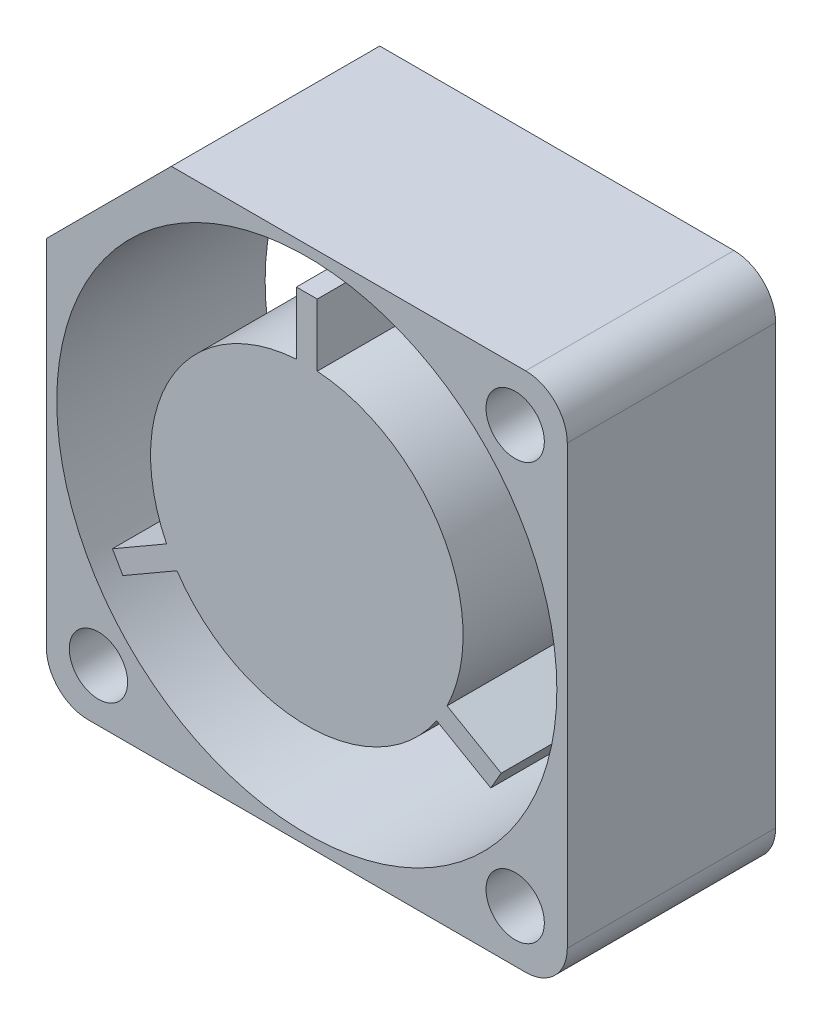
ISO-10303-21;
HEADER;
FILE_DESCRIPTION(('STEP AP214'),'2;1');
FILE_NAME('part.step','',(''),(''),'','','');
FILE_SCHEMA(('AUTOMOTIVE_DESIGN { 1 0 10303 214 1 1 1 1 }'));
ENDSEC;
DATA;
#1=APPLICATION_CONTEXT('core data for automotive mechanical design processes');
#2=APPLICATION_PROTOCOL_DEFINITION('international standard','automotive_design',2000,#1);
#3=PRODUCT_CONTEXT('',#1,'mechanical');
#4=PRODUCT('Part','Part','',(#3));
#5=PRODUCT_RELATED_PRODUCT_CATEGORY('part','',(#4));
#6=PRODUCT_DEFINITION_FORMATION('','',#4);
#7=PRODUCT_DEFINITION_CONTEXT('part definition',#1,'design');
#8=PRODUCT_DEFINITION('design','',#6,#7);
#9=PRODUCT_DEFINITION_SHAPE('','',#8);
#10=(LENGTH_UNIT() NAMED_UNIT(*) SI_UNIT(.MILLI.,.METRE.));
#11=(NAMED_UNIT(*) PLANE_ANGLE_UNIT() SI_UNIT($,.RADIAN.));
#12=(NAMED_UNIT(*) SI_UNIT($,.STERADIAN.) SOLID_ANGLE_UNIT());
#13=UNCERTAINTY_MEASURE_WITH_UNIT(LENGTH_MEASURE(1.E-05),#10,'distance_accuracy_value','');
#14=(GEOMETRIC_REPRESENTATION_CONTEXT(3) GLOBAL_UNCERTAINTY_ASSIGNED_CONTEXT((#13)) GLOBAL_UNIT_ASSIGNED_CONTEXT((#10,
#11,#12)) REPRESENTATION_CONTEXT('',''));
#15=CARTESIAN_POINT('',(0.,0.,0.));
#16=DIRECTION('',(0.,0.,1.));
#17=DIRECTION('',(1.,0.,0.));
#18=AXIS2_PLACEMENT_3D('',#15,#16,#17);
#19=CARTESIAN_POINT('',(-0.5,10.4833147735479,-30.9134503682525));
#20=DIRECTION('',(-1.,0.,0.));
#21=DIRECTION('',(0.,-1.,0.));
#22=AXIS2_PLACEMENT_3D('',#19,#20,#21);
#23=PLANE('',#22);
#24=DIRECTION('',(0.,1.,0.));
#25=VECTOR('',#24,1.);
#26=CARTESIAN_POINT('',(-0.5,10.4833147735479,-5.));
#27=LINE('',#26,#25);
#28=CARTESIAN_POINT('',(-0.500000000000001,7.48331477354788,-5.));
#29=VERTEX_POINT('',#28);
#30=CARTESIAN_POINT('',(-0.5,10.4833147735479,-5.));
#31=VERTEX_POINT('',#30);
#32=EDGE_CURVE('E49',#29,#31,#27,.T.);
#33=ORIENTED_EDGE('',*,*,#32,.F.);
#34=DIRECTION('',(0.,0.,1.));
#35=VECTOR('',#34,1.);
#36=CARTESIAN_POINT('',(-0.500000000000001,7.48331477354788,-30.9134503682525));
#37=LINE('',#36,#35);
#38=CARTESIAN_POINT('',(-0.500000000000001,7.48331477354788,5.));
#39=VERTEX_POINT('',#38);
#40=EDGE_CURVE('E123',#29,#39,#37,.T.);
#41=ORIENTED_EDGE('',*,*,#40,.T.);
#42=DIRECTION('',(0.,-1.,0.));
#43=VECTOR('',#42,1.);
#44=CARTESIAN_POINT('',(-0.5,10.4833147735479,5.));
#45=LINE('',#44,#43);
#46=CARTESIAN_POINT('',(-0.5,10.4833147735479,5.));
#47=VERTEX_POINT('',#46);
#48=EDGE_CURVE('E227',#47,#39,#45,.T.);
#49=ORIENTED_EDGE('',*,*,#48,.F.);
#50=DIRECTION('',(0.,0.,1.));
#51=VECTOR('',#50,1.);
#52=CARTESIAN_POINT('',(-0.5,10.4833147735479,-30.9134503682525));
#53=LINE('',#52,#51);
#54=EDGE_CURVE('E143',#31,#47,#53,.T.);
#55=ORIENTED_EDGE('',*,*,#54,.F.);
#56=EDGE_LOOP('',(#33,#41,#49,#55));
#57=FACE_BOUND('',#56,.T.);
#58=ADVANCED_FACE('F41',(#57),#23,.T.);
#59=CARTESIAN_POINT('',(-0.5,10.4833147735479,-30.9134503682525));
#60=DIRECTION('',(0.,1.,0.));
#61=DIRECTION('',(0.,0.,1.));
#62=AXIS2_PLACEMENT_3D('',#59,#60,#61);
#63=PLANE('',#62);
#64=DIRECTION('',(1.,0.,0.));
#65=VECTOR('',#64,1.);
#66=CARTESIAN_POINT('',(-0.5,10.4833147735479,-5.));
#67=LINE('',#66,#65);
#68=CARTESIAN_POINT('',(0.5,10.4833147735479,-5.));
#69=VERTEX_POINT('',#68);
#70=EDGE_CURVE('E238',#31,#69,#67,.T.);
#71=ORIENTED_EDGE('',*,*,#70,.F.);
#72=ORIENTED_EDGE('',*,*,#54,.T.);
#73=DIRECTION('',(-1.,0.,0.));
#74=VECTOR('',#73,1.);
#75=CARTESIAN_POINT('',(-0.5,10.4833147735479,5.));
#76=LINE('',#75,#74);
#77=CARTESIAN_POINT('',(0.5,10.4833147735479,5.));
#78=VERTEX_POINT('',#77);
#79=EDGE_CURVE('E125',#78,#47,#76,.T.);
#80=ORIENTED_EDGE('',*,*,#79,.F.);
#81=DIRECTION('',(0.,0.,1.));
#82=VECTOR('',#81,1.);
#83=CARTESIAN_POINT('',(0.5,10.4833147735479,-30.9134503682525));
#84=LINE('',#83,#82);
#85=EDGE_CURVE('E146',#69,#78,#84,.T.);
#86=ORIENTED_EDGE('',*,*,#85,.F.);
#87=EDGE_LOOP('',(#71,#72,#80,#86));
#88=FACE_BOUND('',#87,.T.);
#89=ADVANCED_FACE('F265',(#88),#63,.T.);
#90=CARTESIAN_POINT('',(0.5,10.4833147735479,-30.9134503682525));
#91=DIRECTION('',(1.,0.,0.));
#92=DIRECTION('',(0.,1.,0.));
#93=AXIS2_PLACEMENT_3D('',#90,#91,#92);
#94=PLANE('',#93);
#95=DIRECTION('',(0.,-1.,0.));
#96=VECTOR('',#95,1.);
#97=CARTESIAN_POINT('',(0.5,10.4833147735479,-5.));
#98=LINE('',#97,#96);
#99=CARTESIAN_POINT('',(0.500000000000001,7.48331477354788,-5.));
#100=VERTEX_POINT('',#99);
#101=EDGE_CURVE('E240',#69,#100,#98,.T.);
#102=ORIENTED_EDGE('',*,*,#101,.F.);
#103=ORIENTED_EDGE('',*,*,#85,.T.);
#104=DIRECTION('',(0.,1.,0.));
#105=VECTOR('',#104,1.);
#106=CARTESIAN_POINT('',(0.5,10.4833147735479,5.));
#107=LINE('',#106,#105);
#108=CARTESIAN_POINT('',(0.500000000000001,7.48331477354788,5.));
#109=VERTEX_POINT('',#108);
#110=EDGE_CURVE('E132',#109,#78,#107,.T.);
#111=ORIENTED_EDGE('',*,*,#110,.F.);
#112=DIRECTION('',(0.,0.,1.));
#113=VECTOR('',#112,1.);
#114=CARTESIAN_POINT('',(0.500000000000001,7.48331477354788,-30.9134503682525));
#115=LINE('',#114,#113);
#116=EDGE_CURVE('E149',#100,#109,#115,.T.);
#117=ORIENTED_EDGE('',*,*,#116,.F.);
#118=EDGE_LOOP('',(#102,#103,#111,#117));
#119=FACE_BOUND('',#118,.T.);
#120=ADVANCED_FACE('F262',(#119),#94,.T.);
#121=CARTESIAN_POINT('',(0.,0.,-30.9134503682525));
#122=DIRECTION('',(0.,0.,1.));
#123=DIRECTION('',(1.,0.,0.));
#124=AXIS2_PLACEMENT_3D('',#121,#122,#123);
#125=CYLINDRICAL_SURFACE('',#124,7.5);
#126=CARTESIAN_POINT('',(0.,0.,-5.));
#127=DIRECTION('',(0.,0.,1.));
#128=DIRECTION('',(1.,0.,0.));
#129=AXIS2_PLACEMENT_3D('',#126,#127,#128);
#130=CIRCLE('',#129,7.5);
#131=CARTESIAN_POINT('',(6.73074069840784,-3.30864468488175,-5.));
#132=VERTEX_POINT('',#131);
#133=EDGE_CURVE('E242',#100,#132,#130,.F.);
#134=ORIENTED_EDGE('',*,*,#133,.F.);
#135=ORIENTED_EDGE('',*,*,#116,.T.);
#136=CARTESIAN_POINT('',(0.,0.,5.));
#137=DIRECTION('',(0.,0.,1.));
#138=DIRECTION('',(1.,0.,0.));
#139=AXIS2_PLACEMENT_3D('',#136,#137,#138);
#140=CIRCLE('',#139,7.5);
#141=CARTESIAN_POINT('',(6.73074069840784,-3.30864468488175,5.));
#142=VERTEX_POINT('',#141);
#143=EDGE_CURVE('E139',#142,#109,#140,.T.);
#144=ORIENTED_EDGE('',*,*,#143,.F.);
#145=DIRECTION('',(0.,0.,1.));
#146=VECTOR('',#145,1.);
#147=CARTESIAN_POINT('',(6.73074069840784,-3.30864468488175,-30.9134503682525));
#148=LINE('',#147,#146);
#149=EDGE_CURVE('E152',#132,#142,#148,.T.);
#150=ORIENTED_EDGE('',*,*,#149,.F.);
#151=EDGE_LOOP('',(#134,#135,#144,#150));
#152=FACE_BOUND('',#151,.T.);
#153=ADVANCED_FACE('F202',(#152),#125,.T.);
#154=CARTESIAN_POINT('',(9.32881690976115,-4.80864468488176,-30.9134503682525));
#155=DIRECTION('',(0.500000000000005,0.866025403784436,0.));
#156=DIRECTION('',(-0.866025403784436,0.500000000000005,0.));
#157=AXIS2_PLACEMENT_3D('',#154,#155,#156);
#158=PLANE('',#157);
#159=DIRECTION('',(0.866025403784436,-0.500000000000005,0.));
#160=VECTOR('',#159,1.);
#161=CARTESIAN_POINT('',(9.32881690976115,-4.80864468488176,-5.));
#162=LINE('',#161,#160);
#163=CARTESIAN_POINT('',(9.32881690976115,-4.80864468488176,-5.));
#164=VERTEX_POINT('',#163);
#165=EDGE_CURVE('E244',#132,#164,#162,.T.);
#166=ORIENTED_EDGE('',*,*,#165,.F.);
#167=ORIENTED_EDGE('',*,*,#149,.T.);
#168=DIRECTION('',(-0.866025403784436,0.500000000000005,0.));
#169=VECTOR('',#168,1.);
#170=CARTESIAN_POINT('',(9.32881690976115,-4.80864468488176,5.));
#171=LINE('',#170,#169);
#172=CARTESIAN_POINT('',(9.32881690976115,-4.80864468488176,5.));
#173=VERTEX_POINT('',#172);
#174=EDGE_CURVE('E189',#173,#142,#171,.T.);
#175=ORIENTED_EDGE('',*,*,#174,.F.);
#176=DIRECTION('',(0.,0.,1.));
#177=VECTOR('',#176,1.);
#178=CARTESIAN_POINT('',(9.32881690976115,-4.80864468488176,-30.9134503682525));
#179=LINE('',#178,#177);
#180=EDGE_CURVE('E155',#164,#173,#179,.T.);
#181=ORIENTED_EDGE('',*,*,#180,.F.);
#182=EDGE_LOOP('',(#166,#167,#175,#181));
#183=FACE_BOUND('',#182,.T.);
#184=ADVANCED_FACE('F254',(#183),#158,.T.);
#185=CARTESIAN_POINT('',(8.82881690976115,-5.6746700886662,-30.9134503682525));
#186=DIRECTION('',(0.866025403784437,-0.500000000000003,0.));
#187=DIRECTION('',(0.500000000000003,0.866025403784437,0.));
#188=AXIS2_PLACEMENT_3D('',#185,#186,#187);
#189=PLANE('',#188);
#190=DIRECTION('',(-0.500000000000003,-0.866025403784437,0.));
#191=VECTOR('',#190,1.);
#192=CARTESIAN_POINT('',(8.82881690976115,-5.6746700886662,-5.));
#193=LINE('',#192,#191);
#194=CARTESIAN_POINT('',(8.82881690976115,-5.6746700886662,-5.));
#195=VERTEX_POINT('',#194);
#196=EDGE_CURVE('E246',#164,#195,#193,.T.);
#197=ORIENTED_EDGE('',*,*,#196,.F.);
#198=ORIENTED_EDGE('',*,*,#180,.T.);
#199=DIRECTION('',(0.500000000000003,0.866025403784437,0.));
#200=VECTOR('',#199,1.);
#201=CARTESIAN_POINT('',(8.82881690976115,-5.6746700886662,5.));
#202=LINE('',#201,#200);
#203=CARTESIAN_POINT('',(8.82881690976115,-5.6746700886662,5.));
#204=VERTEX_POINT('',#203);
#205=EDGE_CURVE('E180',#204,#173,#202,.T.);
#206=ORIENTED_EDGE('',*,*,#205,.F.);
#207=DIRECTION('',(0.,0.,1.));
#208=VECTOR('',#207,1.);
#209=CARTESIAN_POINT('',(8.82881690976115,-5.6746700886662,-30.9134503682525));
#210=LINE('',#209,#208);
#211=EDGE_CURVE('E158',#195,#204,#210,.T.);
#212=ORIENTED_EDGE('',*,*,#211,.F.);
#213=EDGE_LOOP('',(#197,#198,#206,#212));
#214=FACE_BOUND('',#213,.T.);
#215=ADVANCED_FACE('F252',(#214),#189,.T.);
#216=CARTESIAN_POINT('',(6.23074069840784,-4.17467008866619,-30.9134503682525));
#217=DIRECTION('',(-0.500000000000004,-0.866025403784436,0.));
#218=DIRECTION('',(0.866025403784436,-0.500000000000004,0.));
#219=AXIS2_PLACEMENT_3D('',#216,#217,#218);
#220=PLANE('',#219);
#221=DIRECTION('',(-0.866025403784436,0.500000000000004,0.));
#222=VECTOR('',#221,1.);
#223=CARTESIAN_POINT('',(6.23074069840784,-4.17467008866619,-5.));
#224=LINE('',#223,#222);
#225=CARTESIAN_POINT('',(6.23074069840784,-4.17467008866619,-5.));
#226=VERTEX_POINT('',#225);
#227=EDGE_CURVE('E248',#195,#226,#224,.T.);
#228=ORIENTED_EDGE('',*,*,#227,.F.);
#229=ORIENTED_EDGE('',*,*,#211,.T.);
#230=DIRECTION('',(0.866025403784436,-0.500000000000004,0.));
#231=VECTOR('',#230,1.);
#232=CARTESIAN_POINT('',(6.23074069840784,-4.17467008866619,5.));
#233=LINE('',#232,#231);
#234=CARTESIAN_POINT('',(6.23074069840784,-4.17467008866619,5.));
#235=VERTEX_POINT('',#234);
#236=EDGE_CURVE('E175',#235,#204,#233,.T.);
#237=ORIENTED_EDGE('',*,*,#236,.F.);
#238=DIRECTION('',(0.,0.,1.));
#239=VECTOR('',#238,1.);
#240=CARTESIAN_POINT('',(6.23074069840784,-4.17467008866619,-30.9134503682525));
#241=LINE('',#240,#239);
#242=EDGE_CURVE('E116',#226,#235,#241,.T.);
#243=ORIENTED_EDGE('',*,*,#242,.F.);
#244=EDGE_LOOP('',(#228,#229,#237,#243));
#245=FACE_BOUND('',#244,.T.);
#246=ADVANCED_FACE('F176',(#245),#220,.T.);
#247=CARTESIAN_POINT('',(0.,0.,-30.9134503682525));
#248=DIRECTION('',(0.,0.,1.));
#249=DIRECTION('',(1.,0.,0.));
#250=AXIS2_PLACEMENT_3D('',#247,#248,#249);
#251=CYLINDRICAL_SURFACE('',#250,7.5);
#252=CARTESIAN_POINT('',(0.,0.,-5.));
#253=DIRECTION('',(0.,0.,1.));
#254=DIRECTION('',(1.,0.,0.));
#255=AXIS2_PLACEMENT_3D('',#252,#253,#254);
#256=CIRCLE('',#255,7.5);
#257=CARTESIAN_POINT('',(-6.23074069840784,-4.17467008866619,-5.));
#258=VERTEX_POINT('',#257);
#259=EDGE_CURVE('E92',#226,#258,#256,.F.);
#260=ORIENTED_EDGE('',*,*,#259,.F.);
#261=ORIENTED_EDGE('',*,*,#242,.T.);
#262=CARTESIAN_POINT('',(0.,0.,5.));
#263=DIRECTION('',(0.,0.,1.));
#264=DIRECTION('',(1.,0.,0.));
#265=AXIS2_PLACEMENT_3D('',#262,#263,#264);
#266=CIRCLE('',#265,7.5);
#267=CARTESIAN_POINT('',(-6.23074069840784,-4.17467008866619,5.));
#268=VERTEX_POINT('',#267);
#269=EDGE_CURVE('E169',#268,#235,#266,.T.);
#270=ORIENTED_EDGE('',*,*,#269,.F.);
#271=DIRECTION('',(0.,0.,1.));
#272=VECTOR('',#271,1.);
#273=CARTESIAN_POINT('',(-6.23074069840784,-4.17467008866619,-30.9134503682525));
#274=LINE('',#273,#272);
#275=EDGE_CURVE('E114',#258,#268,#274,.T.);
#276=ORIENTED_EDGE('',*,*,#275,.F.);
#277=EDGE_LOOP('',(#260,#261,#270,#276));
#278=FACE_BOUND('',#277,.T.);
#279=ADVANCED_FACE('F166',(#278),#251,.T.);
#280=CARTESIAN_POINT('',(-8.82881690976115,-5.6746700886662,-30.9134503682525));
#281=DIRECTION('',(0.500000000000004,-0.866025403784436,0.));
#282=DIRECTION('',(0.866025403784436,0.500000000000004,0.));
#283=AXIS2_PLACEMENT_3D('',#280,#281,#282);
#284=PLANE('',#283);
#285=DIRECTION('',(-0.866025403784436,-0.500000000000004,0.));
#286=VECTOR('',#285,1.);
#287=CARTESIAN_POINT('',(-8.82881690976115,-5.6746700886662,-5.));
#288=LINE('',#287,#286);
#289=CARTESIAN_POINT('',(-8.82881690976115,-5.6746700886662,-5.));
#290=VERTEX_POINT('',#289);
#291=EDGE_CURVE('E86',#258,#290,#288,.T.);
#292=ORIENTED_EDGE('',*,*,#291,.F.);
#293=ORIENTED_EDGE('',*,*,#275,.T.);
#294=DIRECTION('',(0.866025403784436,0.500000000000004,0.));
#295=VECTOR('',#294,1.);
#296=CARTESIAN_POINT('',(-8.82881690976115,-5.6746700886662,5.));
#297=LINE('',#296,#295);
#298=CARTESIAN_POINT('',(-8.82881690976115,-5.6746700886662,5.));
#299=VERTEX_POINT('',#298);
#300=EDGE_CURVE('E112',#299,#268,#297,.T.);
#301=ORIENTED_EDGE('',*,*,#300,.F.);
#302=DIRECTION('',(0.,0.,1.));
#303=VECTOR('',#302,1.);
#304=CARTESIAN_POINT('',(-8.82881690976115,-5.6746700886662,-30.9134503682525));
#305=LINE('',#304,#303);
#306=EDGE_CURVE('E104',#290,#299,#305,.T.);
#307=ORIENTED_EDGE('',*,*,#306,.F.);
#308=EDGE_LOOP('',(#292,#293,#301,#307));
#309=FACE_BOUND('',#308,.T.);
#310=ADVANCED_FACE('F110',(#309),#284,.T.);
#311=CARTESIAN_POINT('',(-9.32881690976115,-4.80864468488177,-30.9134503682525));
#312=DIRECTION('',(-0.866025403784437,-0.500000000000003,0.));
#313=DIRECTION('',(0.500000000000003,-0.866025403784437,0.));
#314=AXIS2_PLACEMENT_3D('',#311,#312,#313);
#315=PLANE('',#314);
#316=DIRECTION('',(-0.500000000000003,0.866025403784437,0.));
#317=VECTOR('',#316,1.);
#318=CARTESIAN_POINT('',(-9.32881690976115,-4.80864468488177,-5.));
#319=LINE('',#318,#317);
#320=CARTESIAN_POINT('',(-9.32881690976115,-4.80864468488177,-5.));
#321=VERTEX_POINT('',#320);
#322=EDGE_CURVE('E89',#290,#321,#319,.T.);
#323=ORIENTED_EDGE('',*,*,#322,.F.);
#324=ORIENTED_EDGE('',*,*,#306,.T.);
#325=DIRECTION('',(0.500000000000003,-0.866025403784437,0.));
#326=VECTOR('',#325,1.);
#327=CARTESIAN_POINT('',(-9.32881690976115,-4.80864468488177,5.));
#328=LINE('',#327,#326);
#329=CARTESIAN_POINT('',(-9.32881690976115,-4.80864468488177,5.));
#330=VERTEX_POINT('',#329);
#331=EDGE_CURVE('E184',#330,#299,#328,.T.);
#332=ORIENTED_EDGE('',*,*,#331,.F.);
#333=DIRECTION('',(0.,0.,1.));
#334=VECTOR('',#333,1.);
#335=CARTESIAN_POINT('',(-9.32881690976115,-4.80864468488177,-30.9134503682525));
#336=LINE('',#335,#334);
#337=EDGE_CURVE('E107',#321,#330,#336,.T.);
#338=ORIENTED_EDGE('',*,*,#337,.F.);
#339=EDGE_LOOP('',(#323,#324,#332,#338));
#340=FACE_BOUND('',#339,.T.);
#341=ADVANCED_FACE('F101',(#340),#315,.T.);
#342=CARTESIAN_POINT('',(-6.73074069840784,-3.30864468488176,-30.9134503682525));
#343=DIRECTION('',(-0.500000000000004,0.866025403784436,0.));
#344=DIRECTION('',(-0.866025403784436,-0.500000000000004,0.));
#345=AXIS2_PLACEMENT_3D('',#342,#343,#344);
#346=PLANE('',#345);
#347=DIRECTION('',(0.866025403784436,0.500000000000004,0.));
#348=VECTOR('',#347,1.);
#349=CARTESIAN_POINT('',(-6.73074069840784,-3.30864468488176,-5.));
#350=LINE('',#349,#348);
#351=CARTESIAN_POINT('',(-6.73074069840784,-3.30864468488176,-5.));
#352=VERTEX_POINT('',#351);
#353=EDGE_CURVE('E108',#321,#352,#350,.T.);
#354=ORIENTED_EDGE('',*,*,#353,.F.);
#355=ORIENTED_EDGE('',*,*,#337,.T.);
#356=DIRECTION('',(-0.866025403784436,-0.500000000000004,0.));
#357=VECTOR('',#356,1.);
#358=CARTESIAN_POINT('',(-6.73074069840784,-3.30864468488176,5.));
#359=LINE('',#358,#357);
#360=CARTESIAN_POINT('',(-6.73074069840784,-3.30864468488176,5.));
#361=VERTEX_POINT('',#360);
#362=EDGE_CURVE('E221',#361,#330,#359,.T.);
#363=ORIENTED_EDGE('',*,*,#362,.F.);
#364=DIRECTION('',(0.,0.,1.));
#365=VECTOR('',#364,1.);
#366=CARTESIAN_POINT('',(-6.73074069840784,-3.30864468488176,-30.9134503682525));
#367=LINE('',#366,#365);
#368=EDGE_CURVE('E118',#352,#361,#367,.T.);
#369=ORIENTED_EDGE('',*,*,#368,.F.);
#370=EDGE_LOOP('',(#354,#355,#363,#369));
#371=FACE_BOUND('',#370,.T.);
#372=ADVANCED_FACE('F218',(#371),#346,.T.);
#373=CARTESIAN_POINT('',(0.,0.,-30.9134503682525));
#374=DIRECTION('',(0.,0.,1.));
#375=DIRECTION('',(1.,0.,0.));
#376=AXIS2_PLACEMENT_3D('',#373,#374,#375);
#377=CYLINDRICAL_SURFACE('',#376,7.5);
#378=CARTESIAN_POINT('',(0.,0.,-5.));
#379=DIRECTION('',(0.,0.,1.));
#380=DIRECTION('',(1.,0.,0.));
#381=AXIS2_PLACEMENT_3D('',#378,#379,#380);
#382=CIRCLE('',#381,7.5);
#383=EDGE_CURVE('E12',#352,#29,#382,.F.);
#384=ORIENTED_EDGE('',*,*,#383,.F.);
#385=ORIENTED_EDGE('',*,*,#368,.T.);
#386=CARTESIAN_POINT('',(0.,0.,5.));
#387=DIRECTION('',(0.,0.,1.));
#388=DIRECTION('',(1.,0.,0.));
#389=AXIS2_PLACEMENT_3D('',#386,#387,#388);
#390=CIRCLE('',#389,7.5);
#391=EDGE_CURVE('E225',#39,#361,#390,.T.);
#392=ORIENTED_EDGE('',*,*,#391,.F.);
#393=ORIENTED_EDGE('',*,*,#40,.F.);
#394=EDGE_LOOP('',(#384,#385,#392,#393));
#395=FACE_BOUND('',#394,.T.);
#396=ADVANCED_FACE('F224',(#395),#377,.T.);
#397=CARTESIAN_POINT('',(0.,0.,5.));
#398=DIRECTION('',(0.,0.,1.));
#399=DIRECTION('',(1.,0.,0.));
#400=AXIS2_PLACEMENT_3D('',#397,#398,#399);
#401=PLANE('',#400);
#402=ORIENTED_EDGE('',*,*,#48,.T.);
#403=ORIENTED_EDGE('',*,*,#391,.T.);
#404=ORIENTED_EDGE('',*,*,#362,.T.);
#405=ORIENTED_EDGE('',*,*,#331,.T.);
#406=ORIENTED_EDGE('',*,*,#300,.T.);
#407=ORIENTED_EDGE('',*,*,#269,.T.);
#408=ORIENTED_EDGE('',*,*,#236,.T.);
#409=ORIENTED_EDGE('',*,*,#205,.T.);
#410=ORIENTED_EDGE('',*,*,#174,.T.);
#411=ORIENTED_EDGE('',*,*,#143,.T.);
#412=ORIENTED_EDGE('',*,*,#110,.T.);
#413=ORIENTED_EDGE('',*,*,#79,.T.);
#414=EDGE_LOOP('',(#402,#403,#404,#405,#406,#407,#408,#409,#410,#411,#412,#413));
#415=FACE_BOUND('',#414,.T.);
#416=ADVANCED_FACE('F182',(#415),#401,.T.);
#417=CARTESIAN_POINT('',(-12.5,-12.5,-5.));
#418=DIRECTION('',(0.,0.,1.));
#419=DIRECTION('',(1.,0.,0.));
#420=AXIS2_PLACEMENT_3D('',#417,#418,#419);
#421=PLANE('',#420);
#422=ORIENTED_EDGE('',*,*,#32,.T.);
#423=ORIENTED_EDGE('',*,*,#70,.T.);
#424=ORIENTED_EDGE('',*,*,#101,.T.);
#425=ORIENTED_EDGE('',*,*,#133,.T.);
#426=ORIENTED_EDGE('',*,*,#165,.T.);
#427=ORIENTED_EDGE('',*,*,#196,.T.);
#428=ORIENTED_EDGE('',*,*,#227,.T.);
#429=ORIENTED_EDGE('',*,*,#259,.T.);
#430=ORIENTED_EDGE('',*,*,#291,.T.);
#431=ORIENTED_EDGE('',*,*,#322,.T.);
#432=ORIENTED_EDGE('',*,*,#353,.T.);
#433=ORIENTED_EDGE('',*,*,#383,.T.);
#434=EDGE_LOOP('',(#422,#423,#424,#425,#426,#427,#428,#429,#430,#431,#432,#433));
#435=FACE_BOUND('',#434,.T.);
#436=ADVANCED_FACE('F88',(#435),#421,.F.);
#437=CLOSED_SHELL('',(#58,#89,#120,#153,#184,#215,#246,#279,#310,#341,#372,#396,#416,#436));
#438=MANIFOLD_SOLID_BREP('B2',#437);
#439=CARTESIAN_POINT('',(-12.5,12.5,-5.));
#440=DIRECTION('',(-1.,0.,0.));
#441=DIRECTION('',(0.,0.,1.));
#442=AXIS2_PLACEMENT_3D('',#439,#440,#441);
#443=PLANE('',#442);
#444=DIRECTION('',(0.,0.,1.));
#445=VECTOR('',#444,1.);
#446=CARTESIAN_POINT('',(-12.5,6.5,-5.));
#447=LINE('',#446,#445);
#448=CARTESIAN_POINT('',(-12.5,6.5,-5.));
#449=VERTEX_POINT('',#448);
#450=CARTESIAN_POINT('',(-12.5,6.50000000000001,5.));
#451=VERTEX_POINT('',#450);
#452=EDGE_CURVE('E388',#449,#451,#447,.T.);
#453=ORIENTED_EDGE('',*,*,#452,.F.);
#454=DIRECTION('',(0.,-1.,0.));
#455=VECTOR('',#454,1.);
#456=CARTESIAN_POINT('',(-12.5,12.5,-5.));
#457=LINE('',#456,#455);
#458=CARTESIAN_POINT('',(-12.5,-10.5,-5.));
#459=VERTEX_POINT('',#458);
#460=EDGE_CURVE('E448',#449,#459,#457,.T.);
#461=ORIENTED_EDGE('',*,*,#460,.T.);
#462=DIRECTION('',(0.,0.,1.));
#463=VECTOR('',#462,1.);
#464=CARTESIAN_POINT('',(-12.5,-10.5,-5.));
#465=LINE('',#464,#463);
#466=CARTESIAN_POINT('',(-12.5,-10.5,5.));
#467=VERTEX_POINT('',#466);
#468=EDGE_CURVE('E471',#459,#467,#465,.T.);
#469=ORIENTED_EDGE('',*,*,#468,.T.);
#470=DIRECTION('',(0.,-1.,0.));
#471=VECTOR('',#470,1.);
#472=CARTESIAN_POINT('',(-12.5,12.5,5.));
#473=LINE('',#472,#471);
#474=EDGE_CURVE('E450',#451,#467,#473,.T.);
#475=ORIENTED_EDGE('',*,*,#474,.F.);
#476=EDGE_LOOP('',(#453,#461,#469,#475));
#477=FACE_BOUND('',#476,.T.);
#478=ADVANCED_FACE('F373',(#477),#443,.T.);
#479=CARTESIAN_POINT('',(-12.5,12.5,-5.));
#480=DIRECTION('',(0.,1.,0.));
#481=DIRECTION('',(0.,0.,1.));
#482=AXIS2_PLACEMENT_3D('',#479,#480,#481);
#483=PLANE('',#482);
#484=DIRECTION('',(0.,0.,1.));
#485=VECTOR('',#484,1.);
#486=CARTESIAN_POINT('',(-6.5,12.5,-5.));
#487=LINE('',#486,#485);
#488=CARTESIAN_POINT('',(-6.5,12.5,-5.));
#489=VERTEX_POINT('',#488);
#490=CARTESIAN_POINT('',(-6.5,12.5,5.));
#491=VERTEX_POINT('',#490);
#492=EDGE_CURVE('E440',#489,#491,#487,.T.);
#493=ORIENTED_EDGE('',*,*,#492,.T.);
#494=DIRECTION('',(-1.,0.,0.));
#495=VECTOR('',#494,1.);
#496=CARTESIAN_POINT('',(-12.5,12.5,5.));
#497=LINE('',#496,#495);
#498=CARTESIAN_POINT('',(10.5,12.5,5.));
#499=VERTEX_POINT('',#498);
#500=EDGE_CURVE('E512',#499,#491,#497,.T.);
#501=ORIENTED_EDGE('',*,*,#500,.F.);
#502=DIRECTION('',(0.,0.,1.));
#503=VECTOR('',#502,1.);
#504=CARTESIAN_POINT('',(10.5,12.5,-5.));
#505=LINE('',#504,#503);
#506=CARTESIAN_POINT('',(10.5,12.5,-5.));
#507=VERTEX_POINT('',#506);
#508=EDGE_CURVE('E39',#499,#507,#505,.F.);
#509=ORIENTED_EDGE('',*,*,#508,.T.);
#510=DIRECTION('',(-1.,0.,0.));
#511=VECTOR('',#510,1.);
#512=CARTESIAN_POINT('',(-12.5,12.5,-5.));
#513=LINE('',#512,#511);
#514=EDGE_CURVE('E469',#507,#489,#513,.T.);
#515=ORIENTED_EDGE('',*,*,#514,.T.);
#516=EDGE_LOOP('',(#493,#501,#509,#515));
#517=FACE_BOUND('',#516,.T.);
#518=ADVANCED_FACE('F552',(#517),#483,.T.);
#519=CARTESIAN_POINT('',(12.5,12.5,-5.));
#520=DIRECTION('',(1.,0.,0.));
#521=DIRECTION('',(0.,0.,-1.));
#522=AXIS2_PLACEMENT_3D('',#519,#520,#521);
#523=PLANE('',#522);
#524=DIRECTION('',(0.,1.,0.));
#525=VECTOR('',#524,1.);
#526=CARTESIAN_POINT('',(12.5,12.5,5.));
#527=LINE('',#526,#525);
#528=CARTESIAN_POINT('',(12.5,-10.5,5.));
#529=VERTEX_POINT('',#528);
#530=CARTESIAN_POINT('',(12.5,10.5,5.));
#531=VERTEX_POINT('',#530);
#532=EDGE_CURVE('E496',#529,#531,#527,.T.);
#533=ORIENTED_EDGE('',*,*,#532,.F.);
#534=DIRECTION('',(0.,0.,1.));
#535=VECTOR('',#534,1.);
#536=CARTESIAN_POINT('',(12.5,-10.5,-5.));
#537=LINE('',#536,#535);
#538=CARTESIAN_POINT('',(12.5,-10.5,-5.));
#539=VERTEX_POINT('',#538);
#540=EDGE_CURVE('E381',#529,#539,#537,.F.);
#541=ORIENTED_EDGE('',*,*,#540,.T.);
#542=DIRECTION('',(0.,1.,0.));
#543=VECTOR('',#542,1.);
#544=CARTESIAN_POINT('',(12.5,12.5,-5.));
#545=LINE('',#544,#543);
#546=CARTESIAN_POINT('',(12.5,10.5,-5.));
#547=VERTEX_POINT('',#546);
#548=EDGE_CURVE('E461',#539,#547,#545,.T.);
#549=ORIENTED_EDGE('',*,*,#548,.T.);
#550=DIRECTION('',(0.,0.,1.));
#551=VECTOR('',#550,1.);
#552=CARTESIAN_POINT('',(12.5,10.5,-5.));
#553=LINE('',#552,#551);
#554=EDGE_CURVE('E488',#547,#531,#553,.T.);
#555=ORIENTED_EDGE('',*,*,#554,.T.);
#556=EDGE_LOOP('',(#533,#541,#549,#555));
#557=FACE_BOUND('',#556,.T.);
#558=ADVANCED_FACE('F493',(#557),#523,.T.);
#559=CARTESIAN_POINT('',(-12.5,-12.5,-5.));
#560=DIRECTION('',(0.,-1.,0.));
#561=DIRECTION('',(0.,0.,-1.));
#562=AXIS2_PLACEMENT_3D('',#559,#560,#561);
#563=PLANE('',#562);
#564=DIRECTION('',(1.,0.,0.));
#565=VECTOR('',#564,1.);
#566=CARTESIAN_POINT('',(-12.5,-12.5,5.));
#567=LINE('',#566,#565);
#568=CARTESIAN_POINT('',(-10.5,-12.5,5.));
#569=VERTEX_POINT('',#568);
#570=CARTESIAN_POINT('',(10.5,-12.5,5.));
#571=VERTEX_POINT('',#570);
#572=EDGE_CURVE('E505',#569,#571,#567,.T.);
#573=ORIENTED_EDGE('',*,*,#572,.F.);
#574=DIRECTION('',(0.,0.,1.));
#575=VECTOR('',#574,1.);
#576=CARTESIAN_POINT('',(-10.5,-12.5,-5.));
#577=LINE('',#576,#575);
#578=CARTESIAN_POINT('',(-10.5,-12.5,-5.));
#579=VERTEX_POINT('',#578);
#580=EDGE_CURVE('E482',#569,#579,#577,.F.);
#581=ORIENTED_EDGE('',*,*,#580,.T.);
#582=DIRECTION('',(1.,0.,0.));
#583=VECTOR('',#582,1.);
#584=CARTESIAN_POINT('',(-12.5,-12.5,-5.));
#585=LINE('',#584,#583);
#586=CARTESIAN_POINT('',(10.5,-12.5,-5.));
#587=VERTEX_POINT('',#586);
#588=EDGE_CURVE('E457',#579,#587,#585,.T.);
#589=ORIENTED_EDGE('',*,*,#588,.T.);
#590=DIRECTION('',(0.,0.,1.));
#591=VECTOR('',#590,1.);
#592=CARTESIAN_POINT('',(10.5,-12.5,-5.));
#593=LINE('',#592,#591);
#594=EDGE_CURVE('E479',#587,#571,#593,.T.);
#595=ORIENTED_EDGE('',*,*,#594,.T.);
#596=EDGE_LOOP('',(#573,#581,#589,#595));
#597=FACE_BOUND('',#596,.T.);
#598=ADVANCED_FACE('F504',(#597),#563,.T.);
#599=CARTESIAN_POINT('',(-12.5,-12.5,-5.));
#600=DIRECTION('',(0.,0.,1.));
#601=DIRECTION('',(1.,0.,0.));
#602=AXIS2_PLACEMENT_3D('',#599,#600,#601);
#603=PLANE('',#602);
#604=CARTESIAN_POINT('',(0.,0.,-5.));
#605=DIRECTION('',(0.,0.,1.));
#606=DIRECTION('',(1.,0.,0.));
#607=AXIS2_PLACEMENT_3D('',#604,#605,#606);
#608=CIRCLE('',#607,12.);
#609=CARTESIAN_POINT('',(12.,0.,-5.));
#610=VERTEX_POINT('',#609);
#611=EDGE_CURVE('E520',#610,#610,#608,.T.);
#612=ORIENTED_EDGE('',*,*,#611,.T.);
#613=EDGE_LOOP('',(#612));
#614=FACE_BOUND('',#613,.T.);
#615=CARTESIAN_POINT('',(-10.,-10.,-5.));
#616=DIRECTION('',(0.,0.,1.));
#617=DIRECTION('',(1.,0.,0.));
#618=AXIS2_PLACEMENT_3D('',#615,#616,#617);
#619=CIRCLE('',#618,1.4);
#620=CARTESIAN_POINT('',(-8.6,-10.,-5.));
#621=VERTEX_POINT('',#620);
#622=EDGE_CURVE('E523',#621,#621,#619,.T.);
#623=ORIENTED_EDGE('',*,*,#622,.T.);
#624=EDGE_LOOP('',(#623));
#625=FACE_BOUND('',#624,.T.);
#626=CARTESIAN_POINT('',(10.,-10.,-5.));
#627=DIRECTION('',(0.,0.,1.));
#628=DIRECTION('',(1.,0.,0.));
#629=AXIS2_PLACEMENT_3D('',#626,#627,#628);
#630=CIRCLE('',#629,1.4);
#631=CARTESIAN_POINT('',(11.4,-10.,-5.));
#632=VERTEX_POINT('',#631);
#633=EDGE_CURVE('E464',#632,#632,#630,.T.);
#634=ORIENTED_EDGE('',*,*,#633,.T.);
#635=EDGE_LOOP('',(#634));
#636=FACE_BOUND('',#635,.T.);
#637=CARTESIAN_POINT('',(10.,10.,-5.));
#638=DIRECTION('',(0.,0.,1.));
#639=DIRECTION('',(1.,0.,0.));
#640=AXIS2_PLACEMENT_3D('',#637,#638,#639);
#641=CIRCLE('',#640,1.4);
#642=CARTESIAN_POINT('',(11.4,10.,-5.));
#643=VERTEX_POINT('',#642);
#644=EDGE_CURVE('E458',#643,#643,#641,.T.);
#645=ORIENTED_EDGE('',*,*,#644,.T.);
#646=EDGE_LOOP('',(#645));
#647=FACE_BOUND('',#646,.T.);
#648=ORIENTED_EDGE('',*,*,#460,.F.);
#649=DIRECTION('',(0.707106781186547,0.707106781186547,0.));
#650=VECTOR('',#649,1.);
#651=CARTESIAN_POINT('',(-6.5,12.5,-5.));
#652=LINE('',#651,#650);
#653=EDGE_CURVE('E437',#449,#489,#652,.T.);
#654=ORIENTED_EDGE('',*,*,#653,.T.);
#655=ORIENTED_EDGE('',*,*,#514,.F.);
#656=CARTESIAN_POINT('',(10.5,10.5,-5.));
#657=DIRECTION('',(0.,0.,1.));
#658=DIRECTION('',(1.,0.,0.));
#659=AXIS2_PLACEMENT_3D('',#656,#657,#658);
#660=CIRCLE('',#659,2.);
#661=EDGE_CURVE('E396',#507,#547,#660,.F.);
#662=ORIENTED_EDGE('',*,*,#661,.T.);
#663=ORIENTED_EDGE('',*,*,#548,.F.);
#664=CARTESIAN_POINT('',(10.5,-10.5,-5.));
#665=DIRECTION('',(0.,0.,1.));
#666=DIRECTION('',(1.,0.,0.));
#667=AXIS2_PLACEMENT_3D('',#664,#665,#666);
#668=CIRCLE('',#667,2.);
#669=EDGE_CURVE('E485',#539,#587,#668,.F.);
#670=ORIENTED_EDGE('',*,*,#669,.T.);
#671=ORIENTED_EDGE('',*,*,#588,.F.);
#672=CARTESIAN_POINT('',(-10.5,-10.5,-5.));
#673=DIRECTION('',(0.,0.,1.));
#674=DIRECTION('',(1.,0.,0.));
#675=AXIS2_PLACEMENT_3D('',#672,#673,#674);
#676=CIRCLE('',#675,2.);
#677=EDGE_CURVE('E455',#579,#459,#676,.F.);
#678=ORIENTED_EDGE('',*,*,#677,.T.);
#679=EDGE_LOOP('',(#648,#654,#655,#662,#663,#670,#671,#678));
#680=FACE_BOUND('',#679,.T.);
#681=ADVANCED_FACE('F452',(#614,#625,#636,#647,#680),#603,.F.);
#682=CARTESIAN_POINT('',(10.,10.,-5.));
#683=DIRECTION('',(0.,0.,1.));
#684=DIRECTION('',(1.,0.,0.));
#685=AXIS2_PLACEMENT_3D('',#682,#683,#684);
#686=CYLINDRICAL_SURFACE('',#685,1.4);
#687=ORIENTED_EDGE('',*,*,#644,.F.);
#688=EDGE_LOOP('',(#687));
#689=FACE_BOUND('',#688,.T.);
#690=CARTESIAN_POINT('',(10.,10.,5.));
#691=DIRECTION('',(0.,0.,1.));
#692=DIRECTION('',(1.,0.,0.));
#693=AXIS2_PLACEMENT_3D('',#690,#691,#692);
#694=CIRCLE('',#693,1.4);
#695=CARTESIAN_POINT('',(11.4,10.,5.));
#696=VERTEX_POINT('',#695);
#697=EDGE_CURVE('E514',#696,#696,#694,.T.);
#698=ORIENTED_EDGE('',*,*,#697,.T.);
#699=EDGE_LOOP('',(#698));
#700=FACE_BOUND('',#699,.T.);
#701=ADVANCED_FACE('F534',(#689,#700),#686,.F.);
#702=CARTESIAN_POINT('',(10.,-10.,-5.));
#703=DIRECTION('',(0.,0.,1.));
#704=DIRECTION('',(1.,0.,0.));
#705=AXIS2_PLACEMENT_3D('',#702,#703,#704);
#706=CYLINDRICAL_SURFACE('',#705,1.4);
#707=ORIENTED_EDGE('',*,*,#633,.F.);
#708=EDGE_LOOP('',(#707));
#709=FACE_BOUND('',#708,.T.);
#710=CARTESIAN_POINT('',(10.,-10.,5.));
#711=DIRECTION('',(0.,0.,1.));
#712=DIRECTION('',(1.,0.,0.));
#713=AXIS2_PLACEMENT_3D('',#710,#711,#712);
#714=CIRCLE('',#713,1.4);
#715=CARTESIAN_POINT('',(11.4,-10.,5.));
#716=VERTEX_POINT('',#715);
#717=EDGE_CURVE('E538',#716,#716,#714,.T.);
#718=ORIENTED_EDGE('',*,*,#717,.T.);
#719=EDGE_LOOP('',(#718));
#720=FACE_BOUND('',#719,.T.);
#721=ADVANCED_FACE('F530',(#709,#720),#706,.F.);
#722=CARTESIAN_POINT('',(-10.,-10.,-5.));
#723=DIRECTION('',(0.,0.,1.));
#724=DIRECTION('',(1.,0.,0.));
#725=AXIS2_PLACEMENT_3D('',#722,#723,#724);
#726=CYLINDRICAL_SURFACE('',#725,1.4);
#727=ORIENTED_EDGE('',*,*,#622,.F.);
#728=EDGE_LOOP('',(#727));
#729=FACE_BOUND('',#728,.T.);
#730=CARTESIAN_POINT('',(-10.,-10.,5.));
#731=DIRECTION('',(0.,0.,1.));
#732=DIRECTION('',(1.,0.,0.));
#733=AXIS2_PLACEMENT_3D('',#730,#731,#732);
#734=CIRCLE('',#733,1.4);
#735=CARTESIAN_POINT('',(-8.6,-10.,5.));
#736=VERTEX_POINT('',#735);
#737=EDGE_CURVE('E540',#736,#736,#734,.T.);
#738=ORIENTED_EDGE('',*,*,#737,.T.);
#739=EDGE_LOOP('',(#738));
#740=FACE_BOUND('',#739,.T.);
#741=ADVANCED_FACE('F533',(#729,#740),#726,.F.);
#742=CARTESIAN_POINT('',(0.,0.,-5.));
#743=DIRECTION('',(0.,0.,1.));
#744=DIRECTION('',(1.,0.,0.));
#745=AXIS2_PLACEMENT_3D('',#742,#743,#744);
#746=CYLINDRICAL_SURFACE('',#745,12.);
#747=ORIENTED_EDGE('',*,*,#611,.F.);
#748=EDGE_LOOP('',(#747));
#749=FACE_BOUND('',#748,.T.);
#750=CARTESIAN_POINT('',(0.,0.,5.));
#751=DIRECTION('',(0.,0.,1.));
#752=DIRECTION('',(1.,0.,0.));
#753=AXIS2_PLACEMENT_3D('',#750,#751,#752);
#754=CIRCLE('',#753,12.);
#755=CARTESIAN_POINT('',(12.,0.,5.));
#756=VERTEX_POINT('',#755);
#757=EDGE_CURVE('E544',#756,#756,#754,.T.);
#758=ORIENTED_EDGE('',*,*,#757,.T.);
#759=EDGE_LOOP('',(#758));
#760=FACE_BOUND('',#759,.T.);
#761=ADVANCED_FACE('F576',(#749,#760),#746,.F.);
#762=CARTESIAN_POINT('',(-12.5,-12.5,5.));
#763=DIRECTION('',(0.,0.,1.));
#764=DIRECTION('',(1.,0.,0.));
#765=AXIS2_PLACEMENT_3D('',#762,#763,#764);
#766=PLANE('',#765);
#767=DIRECTION('',(0.707106781186547,0.707106781186547,0.));
#768=VECTOR('',#767,1.);
#769=CARTESIAN_POINT('',(-6.5,12.5,5.));
#770=LINE('',#769,#768);
#771=EDGE_CURVE('E443',#451,#491,#770,.T.);
#772=ORIENTED_EDGE('',*,*,#771,.F.);
#773=ORIENTED_EDGE('',*,*,#474,.T.);
#774=CARTESIAN_POINT('',(-10.5,-10.5,5.));
#775=DIRECTION('',(0.,0.,1.));
#776=DIRECTION('',(1.,0.,0.));
#777=AXIS2_PLACEMENT_3D('',#774,#775,#776);
#778=CIRCLE('',#777,2.);
#779=EDGE_CURVE('E477',#467,#569,#778,.T.);
#780=ORIENTED_EDGE('',*,*,#779,.T.);
#781=ORIENTED_EDGE('',*,*,#572,.T.);
#782=CARTESIAN_POINT('',(10.5,-10.5,5.));
#783=DIRECTION('',(0.,0.,1.));
#784=DIRECTION('',(1.,0.,0.));
#785=AXIS2_PLACEMENT_3D('',#782,#783,#784);
#786=CIRCLE('',#785,2.);
#787=EDGE_CURVE('E475',#571,#529,#786,.T.);
#788=ORIENTED_EDGE('',*,*,#787,.T.);
#789=ORIENTED_EDGE('',*,*,#532,.T.);
#790=CARTESIAN_POINT('',(10.5,10.5,5.));
#791=DIRECTION('',(0.,0.,1.));
#792=DIRECTION('',(1.,0.,0.));
#793=AXIS2_PLACEMENT_3D('',#790,#791,#792);
#794=CIRCLE('',#793,2.);
#795=EDGE_CURVE('E473',#531,#499,#794,.T.);
#796=ORIENTED_EDGE('',*,*,#795,.T.);
#797=ORIENTED_EDGE('',*,*,#500,.T.);
#798=EDGE_LOOP('',(#772,#773,#780,#781,#788,#789,#796,#797));
#799=FACE_BOUND('',#798,.T.);
#800=ORIENTED_EDGE('',*,*,#737,.F.);
#801=EDGE_LOOP('',(#800));
#802=FACE_BOUND('',#801,.T.);
#803=ORIENTED_EDGE('',*,*,#697,.F.);
#804=EDGE_LOOP('',(#803));
#805=FACE_BOUND('',#804,.T.);
#806=ORIENTED_EDGE('',*,*,#717,.F.);
#807=EDGE_LOOP('',(#806));
#808=FACE_BOUND('',#807,.T.);
#809=ORIENTED_EDGE('',*,*,#757,.F.);
#810=EDGE_LOOP('',(#809));
#811=FACE_BOUND('',#810,.T.);
#812=ADVANCED_FACE('F508',(#799,#802,#805,#808,#811),#766,.T.);
#813=CARTESIAN_POINT('',(-10.5,-10.5,-5.));
#814=DIRECTION('',(0.,0.,1.));
#815=DIRECTION('',(1.,0.,0.));
#816=AXIS2_PLACEMENT_3D('',#813,#814,#815);
#817=CYLINDRICAL_SURFACE('',#816,2.);
#818=ORIENTED_EDGE('',*,*,#677,.F.);
#819=ORIENTED_EDGE('',*,*,#580,.F.);
#820=ORIENTED_EDGE('',*,*,#779,.F.);
#821=ORIENTED_EDGE('',*,*,#468,.F.);
#822=EDGE_LOOP('',(#818,#819,#820,#821));
#823=FACE_BOUND('',#822,.T.);
#824=ADVANCED_FACE('F561',(#823),#817,.T.);
#825=CARTESIAN_POINT('',(10.5,-10.5,-5.));
#826=DIRECTION('',(0.,0.,1.));
#827=DIRECTION('',(1.,0.,0.));
#828=AXIS2_PLACEMENT_3D('',#825,#826,#827);
#829=CYLINDRICAL_SURFACE('',#828,2.);
#830=ORIENTED_EDGE('',*,*,#669,.F.);
#831=ORIENTED_EDGE('',*,*,#540,.F.);
#832=ORIENTED_EDGE('',*,*,#787,.F.);
#833=ORIENTED_EDGE('',*,*,#594,.F.);
#834=EDGE_LOOP('',(#830,#831,#832,#833));
#835=FACE_BOUND('',#834,.T.);
#836=ADVANCED_FACE('F500',(#835),#829,.T.);
#837=CARTESIAN_POINT('',(10.5,10.5,-5.));
#838=DIRECTION('',(0.,0.,1.));
#839=DIRECTION('',(1.,0.,0.));
#840=AXIS2_PLACEMENT_3D('',#837,#838,#839);
#841=CYLINDRICAL_SURFACE('',#840,2.);
#842=ORIENTED_EDGE('',*,*,#661,.F.);
#843=ORIENTED_EDGE('',*,*,#508,.F.);
#844=ORIENTED_EDGE('',*,*,#795,.F.);
#845=ORIENTED_EDGE('',*,*,#554,.F.);
#846=EDGE_LOOP('',(#842,#843,#844,#845));
#847=FACE_BOUND('',#846,.T.);
#848=ADVANCED_FACE('F375',(#847),#841,.T.);
#849=CARTESIAN_POINT('',(-6.5,12.5,-5.));
#850=DIRECTION('',(0.707106781186548,-0.707106781186548,0.));
#851=DIRECTION('',(0.707106781186548,0.707106781186548,0.));
#852=AXIS2_PLACEMENT_3D('',#849,#850,#851);
#853=PLANE('',#852);
#854=ORIENTED_EDGE('',*,*,#771,.T.);
#855=ORIENTED_EDGE('',*,*,#492,.F.);
#856=ORIENTED_EDGE('',*,*,#653,.F.);
#857=ORIENTED_EDGE('',*,*,#452,.T.);
#858=EDGE_LOOP('',(#854,#855,#856,#857));
#859=FACE_BOUND('',#858,.T.);
#860=ADVANCED_FACE('F438',(#859),#853,.F.);
#861=CLOSED_SHELL('',(#478,#518,#558,#598,#681,#701,#721,#741,#761,#812,#824,#836,#848,#860));
#862=MANIFOLD_SOLID_BREP('B6',#861);
#863=ADVANCED_BREP_SHAPE_REPRESENTATION('',(#18,#438,#862),#14);
#864=SHAPE_DEFINITION_REPRESENTATION(#9,#863);
ENDSEC;
END-ISO-10303-21;
